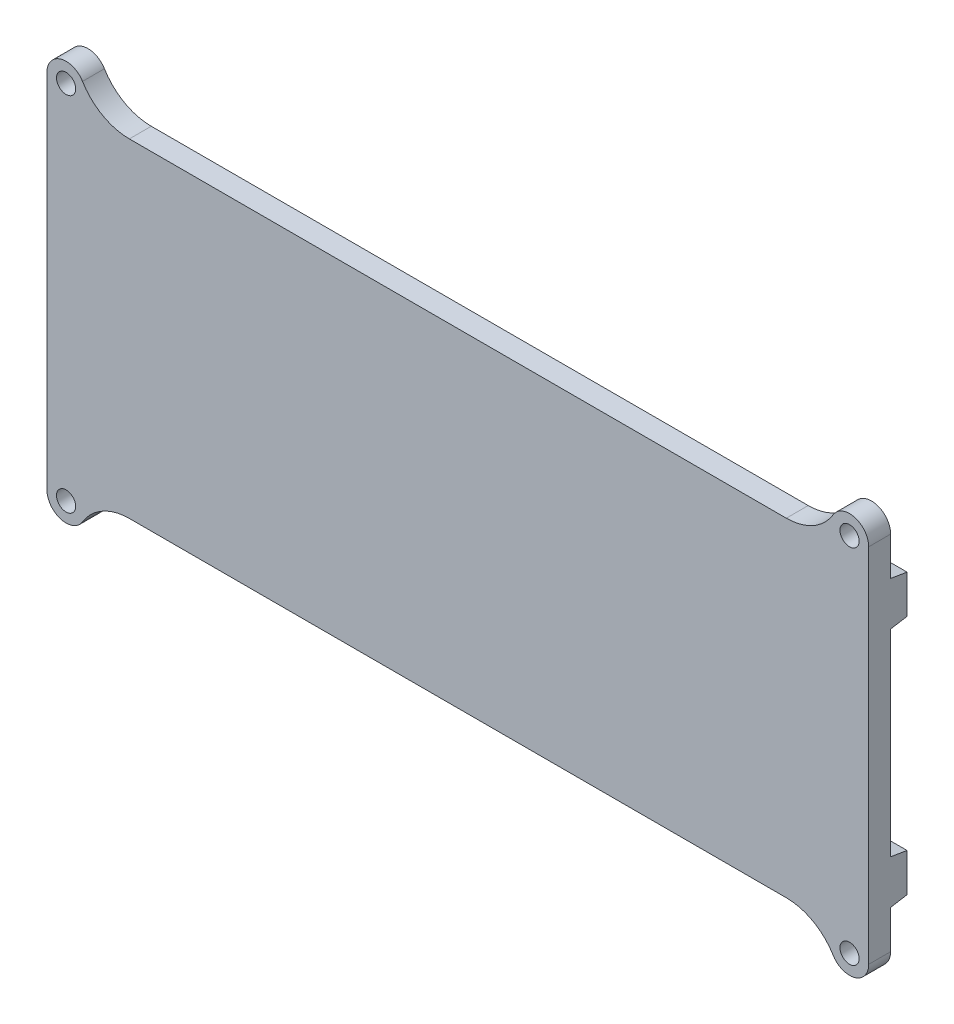
ISO-10303-21;
HEADER;
FILE_DESCRIPTION(('STEP AP214'),'2;1');
FILE_NAME('part.step','',(''),(''),'','','');
FILE_SCHEMA(('AUTOMOTIVE_DESIGN { 1 0 10303 214 1 1 1 1 }'));
ENDSEC;
DATA;
#1=APPLICATION_CONTEXT('core data for automotive mechanical design processes');
#2=APPLICATION_PROTOCOL_DEFINITION('international standard','automotive_design',2000,#1);
#3=PRODUCT_CONTEXT('',#1,'mechanical');
#4=PRODUCT('Part','Part','',(#3));
#5=PRODUCT_RELATED_PRODUCT_CATEGORY('part','',(#4));
#6=PRODUCT_DEFINITION_FORMATION('','',#4);
#7=PRODUCT_DEFINITION_CONTEXT('part definition',#1,'design');
#8=PRODUCT_DEFINITION('design','',#6,#7);
#9=PRODUCT_DEFINITION_SHAPE('','',#8);
#10=(LENGTH_UNIT() NAMED_UNIT(*) SI_UNIT(.MILLI.,.METRE.));
#11=(NAMED_UNIT(*) PLANE_ANGLE_UNIT() SI_UNIT($,.RADIAN.));
#12=(NAMED_UNIT(*) SI_UNIT($,.STERADIAN.) SOLID_ANGLE_UNIT());
#13=UNCERTAINTY_MEASURE_WITH_UNIT(LENGTH_MEASURE(1.E-05),#10,'distance_accuracy_value','');
#14=(GEOMETRIC_REPRESENTATION_CONTEXT(3) GLOBAL_UNCERTAINTY_ASSIGNED_CONTEXT((#13)) GLOBAL_UNIT_ASSIGNED_CONTEXT((#10,
#11,#12)) REPRESENTATION_CONTEXT('',''));
#15=CARTESIAN_POINT('',(0.,0.,0.));
#16=DIRECTION('',(0.,0.,1.));
#17=DIRECTION('',(1.,0.,0.));
#18=AXIS2_PLACEMENT_3D('',#15,#16,#17);
#19=CARTESIAN_POINT('',(0.,0.,0.));
#20=DIRECTION('',(0.,0.,-1.));
#21=DIRECTION('',(-1.,0.,0.));
#22=AXIS2_PLACEMENT_3D('',#19,#20,#21);
#23=PLANE('',#22);
#24=CARTESIAN_POINT('',(71.5,33.,0.));
#25=DIRECTION('',(0.,0.,-1.));
#26=DIRECTION('',(-1.,0.,0.));
#27=AXIS2_PLACEMENT_3D('',#24,#25,#26);
#28=CIRCLE('',#27,1.75);
#29=CARTESIAN_POINT('',(69.75,33.,0.));
#30=VERTEX_POINT('',#29);
#31=EDGE_CURVE('E380',#30,#30,#28,.T.);
#32=ORIENTED_EDGE('',*,*,#31,.F.);
#33=EDGE_LOOP('',(#32));
#34=FACE_BOUND('',#33,.T.);
#35=CARTESIAN_POINT('',(-71.5,33.,0.));
#36=DIRECTION('',(0.,0.,1.));
#37=DIRECTION('',(1.,0.,0.));
#38=AXIS2_PLACEMENT_3D('',#35,#36,#37);
#39=CIRCLE('',#38,1.75);
#40=CARTESIAN_POINT('',(-69.75,33.,0.));
#41=VERTEX_POINT('',#40);
#42=EDGE_CURVE('E366',#41,#41,#39,.T.);
#43=ORIENTED_EDGE('',*,*,#42,.T.);
#44=EDGE_LOOP('',(#43));
#45=FACE_BOUND('',#44,.T.);
#46=CARTESIAN_POINT('',(-71.5,-33.,0.));
#47=DIRECTION('',(0.,0.,-1.));
#48=DIRECTION('',(1.,0.,0.));
#49=AXIS2_PLACEMENT_3D('',#46,#47,#48);
#50=CIRCLE('',#49,1.75);
#51=CARTESIAN_POINT('',(-69.75,-33.,0.));
#52=VERTEX_POINT('',#51);
#53=EDGE_CURVE('E353',#52,#52,#50,.T.);
#54=ORIENTED_EDGE('',*,*,#53,.F.);
#55=EDGE_LOOP('',(#54));
#56=FACE_BOUND('',#55,.T.);
#57=CARTESIAN_POINT('',(71.5,-33.,0.));
#58=DIRECTION('',(0.,0.,1.));
#59=DIRECTION('',(-1.,0.,0.));
#60=AXIS2_PLACEMENT_3D('',#57,#58,#59);
#61=CIRCLE('',#60,1.75);
#62=CARTESIAN_POINT('',(69.75,-33.,0.));
#63=VERTEX_POINT('',#62);
#64=EDGE_CURVE('E334',#63,#63,#61,.T.);
#65=ORIENTED_EDGE('',*,*,#64,.T.);
#66=EDGE_LOOP('',(#65));
#67=FACE_BOUND('',#66,.T.);
#68=DIRECTION('',(0.,1.,0.));
#69=VECTOR('',#68,1.);
#70=CARTESIAN_POINT('',(75.,-30.,0.));
#71=LINE('',#70,#69);
#72=CARTESIAN_POINT('',(75.,26.,0.));
#73=VERTEX_POINT('',#72);
#74=CARTESIAN_POINT('',(75.,33.,0.));
#75=VERTEX_POINT('',#74);
#76=EDGE_CURVE('E418',#73,#75,#71,.T.);
#77=ORIENTED_EDGE('',*,*,#76,.F.);
#78=DIRECTION('',(1.,0.,0.));
#79=VECTOR('',#78,1.);
#80=CARTESIAN_POINT('',(71.,26.,0.));
#81=LINE('',#80,#79);
#82=CARTESIAN_POINT('',(71.,26.,0.));
#83=VERTEX_POINT('',#82);
#84=EDGE_CURVE('E47',#83,#73,#81,.T.);
#85=ORIENTED_EDGE('',*,*,#84,.F.);
#86=DIRECTION('',(0.,1.,0.));
#87=VECTOR('',#86,1.);
#88=CARTESIAN_POINT('',(71.,18.,0.));
#89=LINE('',#88,#87);
#90=CARTESIAN_POINT('',(71.,18.,0.));
#91=VERTEX_POINT('',#90);
#92=EDGE_CURVE('E221',#91,#83,#89,.T.);
#93=ORIENTED_EDGE('',*,*,#92,.F.);
#94=DIRECTION('',(1.,0.,0.));
#95=VECTOR('',#94,1.);
#96=CARTESIAN_POINT('',(71.,18.,0.));
#97=LINE('',#96,#95);
#98=CARTESIAN_POINT('',(75.,18.,0.));
#99=VERTEX_POINT('',#98);
#100=EDGE_CURVE('E229',#91,#99,#97,.T.);
#101=ORIENTED_EDGE('',*,*,#100,.T.);
#102=CARTESIAN_POINT('',(75.,-18.,0.));
#103=VERTEX_POINT('',#102);
#104=EDGE_CURVE('E421',#103,#99,#71,.T.);
#105=ORIENTED_EDGE('',*,*,#104,.F.);
#106=DIRECTION('',(1.,0.,0.));
#107=VECTOR('',#106,1.);
#108=CARTESIAN_POINT('',(71.,-18.,0.));
#109=LINE('',#108,#107);
#110=CARTESIAN_POINT('',(71.,-18.,0.));
#111=VERTEX_POINT('',#110);
#112=EDGE_CURVE('E332',#111,#103,#109,.T.);
#113=ORIENTED_EDGE('',*,*,#112,.F.);
#114=DIRECTION('',(0.,-1.,0.));
#115=VECTOR('',#114,1.);
#116=CARTESIAN_POINT('',(71.,-18.,0.));
#117=LINE('',#116,#115);
#118=CARTESIAN_POINT('',(71.,-26.,0.));
#119=VERTEX_POINT('',#118);
#120=EDGE_CURVE('E311',#111,#119,#117,.T.);
#121=ORIENTED_EDGE('',*,*,#120,.T.);
#122=DIRECTION('',(1.,0.,0.));
#123=VECTOR('',#122,1.);
#124=CARTESIAN_POINT('',(71.,-26.,0.));
#125=LINE('',#124,#123);
#126=CARTESIAN_POINT('',(75.,-26.,0.));
#127=VERTEX_POINT('',#126);
#128=EDGE_CURVE('E324',#119,#127,#125,.T.);
#129=ORIENTED_EDGE('',*,*,#128,.T.);
#130=CARTESIAN_POINT('',(75.,-33.,0.));
#131=VERTEX_POINT('',#130);
#132=EDGE_CURVE('E399',#131,#127,#71,.T.);
#133=ORIENTED_EDGE('',*,*,#132,.F.);
#134=CARTESIAN_POINT('',(71.5,-33.,0.));
#135=DIRECTION('',(0.,0.,1.));
#136=DIRECTION('',(1.,0.,0.));
#137=AXIS2_PLACEMENT_3D('',#134,#135,#136);
#138=CIRCLE('',#137,3.5);
#139=CARTESIAN_POINT('',(68.5072676050257,-34.8148148148148,0.));
#140=VERTEX_POINT('',#139);
#141=EDGE_CURVE('E344',#140,#131,#138,.T.);
#142=ORIENTED_EDGE('',*,*,#141,.F.);
#143=CARTESIAN_POINT('',(59.9566036193848,-40.,0.));
#144=DIRECTION('',(0.,0.,-1.));
#145=DIRECTION('',(-1.,0.,0.));
#146=AXIS2_PLACEMENT_3D('',#143,#144,#145);
#147=CIRCLE('',#146,10.);
#148=CARTESIAN_POINT('',(59.9566036193848,-30.,0.));
#149=VERTEX_POINT('',#148);
#150=EDGE_CURVE('E441',#140,#149,#147,.F.);
#151=ORIENTED_EDGE('',*,*,#150,.T.);
#152=DIRECTION('',(-1.,0.,0.));
#153=VECTOR('',#152,1.);
#154=CARTESIAN_POINT('',(75.,-30.,0.));
#155=LINE('',#154,#153);
#156=CARTESIAN_POINT('',(-59.9566036193848,-30.,0.));
#157=VERTEX_POINT('',#156);
#158=EDGE_CURVE('E394',#149,#157,#155,.T.);
#159=ORIENTED_EDGE('',*,*,#158,.T.);
#160=CARTESIAN_POINT('',(-59.9566036193848,-40.,0.));
#161=DIRECTION('',(0.,0.,-1.));
#162=DIRECTION('',(-1.,0.,0.));
#163=AXIS2_PLACEMENT_3D('',#160,#161,#162);
#164=CIRCLE('',#163,10.);
#165=CARTESIAN_POINT('',(-68.5072676050257,-34.8148148148148,0.));
#166=VERTEX_POINT('',#165);
#167=EDGE_CURVE('E445',#157,#166,#164,.F.);
#168=ORIENTED_EDGE('',*,*,#167,.T.);
#169=CARTESIAN_POINT('',(-71.5,-33.,0.));
#170=DIRECTION('',(0.,0.,-1.));
#171=DIRECTION('',(-1.,0.,0.));
#172=AXIS2_PLACEMENT_3D('',#169,#170,#171);
#173=CIRCLE('',#172,3.5);
#174=CARTESIAN_POINT('',(-75.,-33.,0.));
#175=VERTEX_POINT('',#174);
#176=EDGE_CURVE('E357',#166,#175,#173,.T.);
#177=ORIENTED_EDGE('',*,*,#176,.T.);
#178=DIRECTION('',(0.,1.,0.));
#179=VECTOR('',#178,1.);
#180=CARTESIAN_POINT('',(-75.,-30.,0.));
#181=LINE('',#180,#179);
#182=CARTESIAN_POINT('',(-75.,-26.,0.));
#183=VERTEX_POINT('',#182);
#184=EDGE_CURVE('E412',#175,#183,#181,.T.);
#185=ORIENTED_EDGE('',*,*,#184,.T.);
#186=DIRECTION('',(-1.,0.,0.));
#187=VECTOR('',#186,1.);
#188=CARTESIAN_POINT('',(-71.,-26.,0.));
#189=LINE('',#188,#187);
#190=CARTESIAN_POINT('',(-71.,-26.,0.));
#191=VERTEX_POINT('',#190);
#192=EDGE_CURVE('E299',#191,#183,#189,.T.);
#193=ORIENTED_EDGE('',*,*,#192,.F.);
#194=DIRECTION('',(0.,-1.,0.));
#195=VECTOR('',#194,1.);
#196=CARTESIAN_POINT('',(-71.,-18.,0.));
#197=LINE('',#196,#195);
#198=CARTESIAN_POINT('',(-71.,-18.,0.));
#199=VERTEX_POINT('',#198);
#200=EDGE_CURVE('E282',#199,#191,#197,.T.);
#201=ORIENTED_EDGE('',*,*,#200,.F.);
#202=DIRECTION('',(-1.,0.,0.));
#203=VECTOR('',#202,1.);
#204=CARTESIAN_POINT('',(-71.,-18.,0.));
#205=LINE('',#204,#203);
#206=CARTESIAN_POINT('',(-75.,-18.,0.));
#207=VERTEX_POINT('',#206);
#208=EDGE_CURVE('E293',#199,#207,#205,.T.);
#209=ORIENTED_EDGE('',*,*,#208,.T.);
#210=CARTESIAN_POINT('',(-75.,18.,0.));
#211=VERTEX_POINT('',#210);
#212=EDGE_CURVE('E415',#207,#211,#181,.T.);
#213=ORIENTED_EDGE('',*,*,#212,.T.);
#214=DIRECTION('',(-1.,0.,0.));
#215=VECTOR('',#214,1.);
#216=CARTESIAN_POINT('',(-71.,18.,0.));
#217=LINE('',#216,#215);
#218=CARTESIAN_POINT('',(-71.,18.,0.));
#219=VERTEX_POINT('',#218);
#220=EDGE_CURVE('E273',#219,#211,#217,.T.);
#221=ORIENTED_EDGE('',*,*,#220,.F.);
#222=DIRECTION('',(0.,1.,0.));
#223=VECTOR('',#222,1.);
#224=CARTESIAN_POINT('',(-71.,18.,0.));
#225=LINE('',#224,#223);
#226=CARTESIAN_POINT('',(-71.,26.,0.));
#227=VERTEX_POINT('',#226);
#228=EDGE_CURVE('E55',#219,#227,#225,.T.);
#229=ORIENTED_EDGE('',*,*,#228,.T.);
#230=DIRECTION('',(-1.,0.,0.));
#231=VECTOR('',#230,1.);
#232=CARTESIAN_POINT('',(-71.,26.,0.));
#233=LINE('',#232,#231);
#234=CARTESIAN_POINT('',(-75.,26.,0.));
#235=VERTEX_POINT('',#234);
#236=EDGE_CURVE('E265',#227,#235,#233,.T.);
#237=ORIENTED_EDGE('',*,*,#236,.T.);
#238=CARTESIAN_POINT('',(-75.,33.,0.));
#239=VERTEX_POINT('',#238);
#240=EDGE_CURVE('E411',#235,#239,#181,.T.);
#241=ORIENTED_EDGE('',*,*,#240,.T.);
#242=CARTESIAN_POINT('',(-71.5,33.,0.));
#243=DIRECTION('',(0.,0.,1.));
#244=DIRECTION('',(-1.,0.,0.));
#245=AXIS2_PLACEMENT_3D('',#242,#243,#244);
#246=CIRCLE('',#245,3.5);
#247=CARTESIAN_POINT('',(-68.5072676050257,34.8148148148148,0.));
#248=VERTEX_POINT('',#247);
#249=EDGE_CURVE('E370',#248,#239,#246,.T.);
#250=ORIENTED_EDGE('',*,*,#249,.F.);
#251=CARTESIAN_POINT('',(-59.9566036193848,40.,0.));
#252=DIRECTION('',(0.,0.,-1.));
#253=DIRECTION('',(-1.,0.,0.));
#254=AXIS2_PLACEMENT_3D('',#251,#252,#253);
#255=CIRCLE('',#254,10.);
#256=CARTESIAN_POINT('',(-59.9566036193848,30.,0.));
#257=VERTEX_POINT('',#256);
#258=EDGE_CURVE('E40',#248,#257,#255,.F.);
#259=ORIENTED_EDGE('',*,*,#258,.T.);
#260=DIRECTION('',(-1.,0.,0.));
#261=VECTOR('',#260,1.);
#262=CARTESIAN_POINT('',(75.,30.,0.));
#263=LINE('',#262,#261);
#264=CARTESIAN_POINT('',(59.9566036193848,30.,0.));
#265=VERTEX_POINT('',#264);
#266=EDGE_CURVE('E414',#265,#257,#263,.T.);
#267=ORIENTED_EDGE('',*,*,#266,.F.);
#268=CARTESIAN_POINT('',(59.9566036193848,40.,0.));
#269=DIRECTION('',(0.,0.,-1.));
#270=DIRECTION('',(-1.,0.,0.));
#271=AXIS2_PLACEMENT_3D('',#268,#269,#270);
#272=CIRCLE('',#271,10.);
#273=CARTESIAN_POINT('',(68.5072676050257,34.8148148148148,0.));
#274=VERTEX_POINT('',#273);
#275=EDGE_CURVE('E449',#265,#274,#272,.F.);
#276=ORIENTED_EDGE('',*,*,#275,.T.);
#277=CARTESIAN_POINT('',(71.5,33.,0.));
#278=DIRECTION('',(0.,0.,-1.));
#279=DIRECTION('',(1.,0.,0.));
#280=AXIS2_PLACEMENT_3D('',#277,#278,#279);
#281=CIRCLE('',#280,3.5);
#282=EDGE_CURVE('E384',#274,#75,#281,.T.);
#283=ORIENTED_EDGE('',*,*,#282,.T.);
#284=EDGE_LOOP('',(#77,#85,#93,#101,#105,#113,#121,#129,#133,#142,#151,#159,#168,#177,#185,#193,
#201,#209,#213,#221,#229,#237,#241,#250,#259,#267,#276,#283));
#285=FACE_BOUND('',#284,.T.);
#286=ADVANCED_FACE('F32',(#34,#45,#56,#67,#285),#23,.T.);
#287=CARTESIAN_POINT('',(75.,-30.,4.));
#288=DIRECTION('',(0.,-1.,0.));
#289=DIRECTION('',(1.,0.,0.));
#290=AXIS2_PLACEMENT_3D('',#287,#288,#289);
#291=PLANE('',#290);
#292=ORIENTED_EDGE('',*,*,#158,.F.);
#293=DIRECTION('',(0.,0.,-1.));
#294=VECTOR('',#293,1.);
#295=CARTESIAN_POINT('',(59.9566036193848,-30.,4.));
#296=LINE('',#295,#294);
#297=CARTESIAN_POINT('',(59.9566036193848,-30.,4.));
#298=VERTEX_POINT('',#297);
#299=EDGE_CURVE('E427',#149,#298,#296,.F.);
#300=ORIENTED_EDGE('',*,*,#299,.T.);
#301=DIRECTION('',(-1.,0.,0.));
#302=VECTOR('',#301,1.);
#303=CARTESIAN_POINT('',(75.,-30.,4.));
#304=LINE('',#303,#302);
#305=CARTESIAN_POINT('',(-59.9566036193848,-30.,4.));
#306=VERTEX_POINT('',#305);
#307=EDGE_CURVE('E395',#298,#306,#304,.T.);
#308=ORIENTED_EDGE('',*,*,#307,.T.);
#309=DIRECTION('',(0.,0.,1.));
#310=VECTOR('',#309,1.);
#311=CARTESIAN_POINT('',(-59.9566036193848,-30.,0.));
#312=LINE('',#311,#310);
#313=EDGE_CURVE('E424',#306,#157,#312,.F.);
#314=ORIENTED_EDGE('',*,*,#313,.T.);
#315=EDGE_LOOP('',(#292,#300,#308,#314));
#316=FACE_BOUND('',#315,.T.);
#317=ADVANCED_FACE('F484',(#316),#291,.T.);
#318=CARTESIAN_POINT('',(75.,30.,4.));
#319=DIRECTION('',(0.,-1.,0.));
#320=DIRECTION('',(1.,0.,0.));
#321=AXIS2_PLACEMENT_3D('',#318,#319,#320);
#322=PLANE('',#321);
#323=DIRECTION('',(-1.,0.,0.));
#324=VECTOR('',#323,1.);
#325=CARTESIAN_POINT('',(75.,30.,4.));
#326=LINE('',#325,#324);
#327=CARTESIAN_POINT('',(59.9566036193848,30.,4.));
#328=VERTEX_POINT('',#327);
#329=CARTESIAN_POINT('',(-59.9566036193848,30.,4.));
#330=VERTEX_POINT('',#329);
#331=EDGE_CURVE('E402',#328,#330,#326,.T.);
#332=ORIENTED_EDGE('',*,*,#331,.F.);
#333=DIRECTION('',(0.,0.,-1.));
#334=VECTOR('',#333,1.);
#335=CARTESIAN_POINT('',(59.9566036193848,30.,4.));
#336=LINE('',#335,#334);
#337=EDGE_CURVE('E433',#328,#265,#336,.T.);
#338=ORIENTED_EDGE('',*,*,#337,.T.);
#339=ORIENTED_EDGE('',*,*,#266,.T.);
#340=DIRECTION('',(0.,0.,1.));
#341=VECTOR('',#340,1.);
#342=CARTESIAN_POINT('',(-59.9566036193848,30.,4.));
#343=LINE('',#342,#341);
#344=EDGE_CURVE('E431',#257,#330,#343,.T.);
#345=ORIENTED_EDGE('',*,*,#344,.T.);
#346=EDGE_LOOP('',(#332,#338,#339,#345));
#347=FACE_BOUND('',#346,.T.);
#348=ADVANCED_FACE('F459',(#347),#322,.F.);
#349=CARTESIAN_POINT('',(75.,-30.,4.));
#350=DIRECTION('',(-1.,0.,0.));
#351=DIRECTION('',(0.,0.,1.));
#352=AXIS2_PLACEMENT_3D('',#349,#350,#351);
#353=PLANE('',#352);
#354=ORIENTED_EDGE('',*,*,#132,.T.);
#355=DIRECTION('',(0.,0.164398987305357,-0.986393923832144));
#356=VECTOR('',#355,1.);
#357=CARTESIAN_POINT('',(75.,-26.,0.));
#358=LINE('',#357,#356);
#359=CARTESIAN_POINT('',(75.,-25.5,-3.));
#360=VERTEX_POINT('',#359);
#361=EDGE_CURVE('E302',#127,#360,#358,.T.);
#362=ORIENTED_EDGE('',*,*,#361,.T.);
#363=DIRECTION('',(0.,1.,0.));
#364=VECTOR('',#363,1.);
#365=CARTESIAN_POINT('',(75.,-25.5,-3.));
#366=LINE('',#365,#364);
#367=CARTESIAN_POINT('',(75.,-18.5,-3.));
#368=VERTEX_POINT('',#367);
#369=EDGE_CURVE('E327',#360,#368,#366,.T.);
#370=ORIENTED_EDGE('',*,*,#369,.T.);
#371=DIRECTION('',(0.,0.164398987305356,0.986393923832144));
#372=VECTOR('',#371,1.);
#373=CARTESIAN_POINT('',(75.,-18.5,-3.));
#374=LINE('',#373,#372);
#375=EDGE_CURVE('E315',#368,#103,#374,.T.);
#376=ORIENTED_EDGE('',*,*,#375,.T.);
#377=ORIENTED_EDGE('',*,*,#104,.T.);
#378=DIRECTION('',(0.,-0.164398987305356,0.986393923832144));
#379=VECTOR('',#378,1.);
#380=CARTESIAN_POINT('',(75.,18.5,-3.));
#381=LINE('',#380,#379);
#382=CARTESIAN_POINT('',(75.,18.5,-3.));
#383=VERTEX_POINT('',#382);
#384=EDGE_CURVE('E232',#383,#99,#381,.T.);
#385=ORIENTED_EDGE('',*,*,#384,.F.);
#386=DIRECTION('',(0.,-1.,0.));
#387=VECTOR('',#386,1.);
#388=CARTESIAN_POINT('',(75.,25.5,-3.));
#389=LINE('',#388,#387);
#390=CARTESIAN_POINT('',(75.,25.5,-3.));
#391=VERTEX_POINT('',#390);
#392=EDGE_CURVE('E241',#391,#383,#389,.T.);
#393=ORIENTED_EDGE('',*,*,#392,.F.);
#394=DIRECTION('',(0.,-0.164398987305357,-0.986393923832144));
#395=VECTOR('',#394,1.);
#396=CARTESIAN_POINT('',(75.,26.,0.));
#397=LINE('',#396,#395);
#398=EDGE_CURVE('E239',#73,#391,#397,.T.);
#399=ORIENTED_EDGE('',*,*,#398,.F.);
#400=ORIENTED_EDGE('',*,*,#76,.T.);
#401=DIRECTION('',(0.,0.,-1.));
#402=VECTOR('',#401,1.);
#403=CARTESIAN_POINT('',(75.,33.,4.));
#404=LINE('',#403,#402);
#405=CARTESIAN_POINT('',(75.,33.,4.));
#406=VERTEX_POINT('',#405);
#407=EDGE_CURVE('E389',#406,#75,#404,.T.);
#408=ORIENTED_EDGE('',*,*,#407,.F.);
#409=DIRECTION('',(0.,1.,0.));
#410=VECTOR('',#409,1.);
#411=CARTESIAN_POINT('',(75.,-30.,4.));
#412=LINE('',#411,#410);
#413=CARTESIAN_POINT('',(75.,-33.,4.));
#414=VERTEX_POINT('',#413);
#415=EDGE_CURVE('E405',#414,#406,#412,.T.);
#416=ORIENTED_EDGE('',*,*,#415,.F.);
#417=DIRECTION('',(0.,0.,-1.));
#418=VECTOR('',#417,1.);
#419=CARTESIAN_POINT('',(75.,-33.,4.));
#420=LINE('',#419,#418);
#421=EDGE_CURVE('E349',#414,#131,#420,.T.);
#422=ORIENTED_EDGE('',*,*,#421,.T.);
#423=EDGE_LOOP('',(#354,#362,#370,#376,#377,#385,#393,#399,#400,#408,#416,#422));
#424=FACE_BOUND('',#423,.T.);
#425=ADVANCED_FACE('F501',(#424),#353,.F.);
#426=CARTESIAN_POINT('',(-75.,-30.,4.));
#427=DIRECTION('',(-1.,0.,0.));
#428=DIRECTION('',(0.,0.,1.));
#429=AXIS2_PLACEMENT_3D('',#426,#427,#428);
#430=PLANE('',#429);
#431=ORIENTED_EDGE('',*,*,#184,.F.);
#432=DIRECTION('',(0.,0.,-1.));
#433=VECTOR('',#432,1.);
#434=CARTESIAN_POINT('',(-75.,-33.,4.));
#435=LINE('',#434,#433);
#436=CARTESIAN_POINT('',(-75.,-33.,4.));
#437=VERTEX_POINT('',#436);
#438=EDGE_CURVE('E362',#437,#175,#435,.T.);
#439=ORIENTED_EDGE('',*,*,#438,.F.);
#440=DIRECTION('',(0.,1.,0.));
#441=VECTOR('',#440,1.);
#442=CARTESIAN_POINT('',(-75.,-30.,4.));
#443=LINE('',#442,#441);
#444=CARTESIAN_POINT('',(-75.,33.,4.));
#445=VERTEX_POINT('',#444);
#446=EDGE_CURVE('E398',#437,#445,#443,.T.);
#447=ORIENTED_EDGE('',*,*,#446,.T.);
#448=DIRECTION('',(0.,0.,-1.));
#449=VECTOR('',#448,1.);
#450=CARTESIAN_POINT('',(-75.,33.,4.));
#451=LINE('',#450,#449);
#452=EDGE_CURVE('E375',#445,#239,#451,.T.);
#453=ORIENTED_EDGE('',*,*,#452,.T.);
#454=ORIENTED_EDGE('',*,*,#240,.F.);
#455=DIRECTION('',(0.,-0.164398987305357,-0.986393923832144));
#456=VECTOR('',#455,1.);
#457=CARTESIAN_POINT('',(-75.,26.,0.));
#458=LINE('',#457,#456);
#459=CARTESIAN_POINT('',(-75.,25.5,-3.));
#460=VERTEX_POINT('',#459);
#461=EDGE_CURVE('E249',#235,#460,#458,.T.);
#462=ORIENTED_EDGE('',*,*,#461,.T.);
#463=DIRECTION('',(0.,-1.,0.));
#464=VECTOR('',#463,1.);
#465=CARTESIAN_POINT('',(-75.,25.5,-3.));
#466=LINE('',#465,#464);
#467=CARTESIAN_POINT('',(-75.,18.5,-3.));
#468=VERTEX_POINT('',#467);
#469=EDGE_CURVE('E268',#460,#468,#466,.T.);
#470=ORIENTED_EDGE('',*,*,#469,.T.);
#471=DIRECTION('',(0.,-0.164398987305356,0.986393923832144));
#472=VECTOR('',#471,1.);
#473=CARTESIAN_POINT('',(-75.,18.5,-3.));
#474=LINE('',#473,#472);
#475=EDGE_CURVE('E256',#468,#211,#474,.T.);
#476=ORIENTED_EDGE('',*,*,#475,.T.);
#477=ORIENTED_EDGE('',*,*,#212,.F.);
#478=DIRECTION('',(0.,0.164398987305356,0.986393923832144));
#479=VECTOR('',#478,1.);
#480=CARTESIAN_POINT('',(-75.,-18.5,-3.));
#481=LINE('',#480,#479);
#482=CARTESIAN_POINT('',(-75.,-18.5,-3.));
#483=VERTEX_POINT('',#482);
#484=EDGE_CURVE('E276',#483,#207,#481,.T.);
#485=ORIENTED_EDGE('',*,*,#484,.F.);
#486=DIRECTION('',(0.,1.,0.));
#487=VECTOR('',#486,1.);
#488=CARTESIAN_POINT('',(-75.,-25.5,-3.));
#489=LINE('',#488,#487);
#490=CARTESIAN_POINT('',(-75.,-25.5,-3.));
#491=VERTEX_POINT('',#490);
#492=EDGE_CURVE('E296',#491,#483,#489,.T.);
#493=ORIENTED_EDGE('',*,*,#492,.F.);
#494=DIRECTION('',(0.,0.164398987305357,-0.986393923832144));
#495=VECTOR('',#494,1.);
#496=CARTESIAN_POINT('',(-75.,-26.,0.));
#497=LINE('',#496,#495);
#498=EDGE_CURVE('E286',#183,#491,#497,.T.);
#499=ORIENTED_EDGE('',*,*,#498,.F.);
#500=EDGE_LOOP('',(#431,#439,#447,#453,#454,#462,#470,#476,#477,#485,#493,#499));
#501=FACE_BOUND('',#500,.T.);
#502=ADVANCED_FACE('F473',(#501),#430,.T.);
#503=CARTESIAN_POINT('',(0.,0.,4.));
#504=DIRECTION('',(0.,0.,-1.));
#505=DIRECTION('',(-1.,0.,0.));
#506=AXIS2_PLACEMENT_3D('',#503,#504,#505);
#507=PLANE('',#506);
#508=ORIENTED_EDGE('',*,*,#307,.F.);
#509=CARTESIAN_POINT('',(59.9566036193848,-40.,4.));
#510=DIRECTION('',(0.,0.,-1.));
#511=DIRECTION('',(-1.,0.,0.));
#512=AXIS2_PLACEMENT_3D('',#509,#510,#511);
#513=CIRCLE('',#512,10.);
#514=CARTESIAN_POINT('',(68.5072676050257,-34.8148148148148,4.));
#515=VERTEX_POINT('',#514);
#516=EDGE_CURVE('E443',#298,#515,#513,.T.);
#517=ORIENTED_EDGE('',*,*,#516,.T.);
#518=CARTESIAN_POINT('',(71.5,-33.,4.));
#519=DIRECTION('',(0.,0.,1.));
#520=DIRECTION('',(1.,0.,0.));
#521=AXIS2_PLACEMENT_3D('',#518,#519,#520);
#522=CIRCLE('',#521,3.5);
#523=EDGE_CURVE('E347',#515,#414,#522,.T.);
#524=ORIENTED_EDGE('',*,*,#523,.T.);
#525=ORIENTED_EDGE('',*,*,#415,.T.);
#526=CARTESIAN_POINT('',(71.5,33.,4.));
#527=DIRECTION('',(0.,0.,-1.));
#528=DIRECTION('',(1.,0.,0.));
#529=AXIS2_PLACEMENT_3D('',#526,#527,#528);
#530=CIRCLE('',#529,3.5);
#531=CARTESIAN_POINT('',(68.5072676050257,34.8148148148148,4.));
#532=VERTEX_POINT('',#531);
#533=EDGE_CURVE('E387',#532,#406,#530,.T.);
#534=ORIENTED_EDGE('',*,*,#533,.F.);
#535=CARTESIAN_POINT('',(59.9566036193848,40.,4.));
#536=DIRECTION('',(0.,0.,-1.));
#537=DIRECTION('',(-1.,0.,0.));
#538=AXIS2_PLACEMENT_3D('',#535,#536,#537);
#539=CIRCLE('',#538,10.);
#540=EDGE_CURVE('E451',#532,#328,#539,.T.);
#541=ORIENTED_EDGE('',*,*,#540,.T.);
#542=ORIENTED_EDGE('',*,*,#331,.T.);
#543=CARTESIAN_POINT('',(-59.9566036193848,40.,4.));
#544=DIRECTION('',(0.,0.,-1.));
#545=DIRECTION('',(-1.,0.,0.));
#546=AXIS2_PLACEMENT_3D('',#543,#544,#545);
#547=CIRCLE('',#546,10.);
#548=CARTESIAN_POINT('',(-68.5072676050257,34.8148148148148,4.));
#549=VERTEX_POINT('',#548);
#550=EDGE_CURVE('E11',#330,#549,#547,.T.);
#551=ORIENTED_EDGE('',*,*,#550,.T.);
#552=CARTESIAN_POINT('',(-71.5,33.,4.));
#553=DIRECTION('',(0.,0.,1.));
#554=DIRECTION('',(-1.,0.,0.));
#555=AXIS2_PLACEMENT_3D('',#552,#553,#554);
#556=CIRCLE('',#555,3.5);
#557=EDGE_CURVE('E373',#549,#445,#556,.T.);
#558=ORIENTED_EDGE('',*,*,#557,.T.);
#559=ORIENTED_EDGE('',*,*,#446,.F.);
#560=CARTESIAN_POINT('',(-71.5,-33.,4.));
#561=DIRECTION('',(0.,0.,-1.));
#562=DIRECTION('',(-1.,0.,0.));
#563=AXIS2_PLACEMENT_3D('',#560,#561,#562);
#564=CIRCLE('',#563,3.5);
#565=CARTESIAN_POINT('',(-68.5072676050257,-34.8148148148148,4.));
#566=VERTEX_POINT('',#565);
#567=EDGE_CURVE('E360',#566,#437,#564,.T.);
#568=ORIENTED_EDGE('',*,*,#567,.F.);
#569=CARTESIAN_POINT('',(-59.9566036193848,-40.,4.));
#570=DIRECTION('',(0.,0.,-1.));
#571=DIRECTION('',(-1.,0.,0.));
#572=AXIS2_PLACEMENT_3D('',#569,#570,#571);
#573=CIRCLE('',#572,10.);
#574=EDGE_CURVE('E447',#566,#306,#573,.T.);
#575=ORIENTED_EDGE('',*,*,#574,.T.);
#576=EDGE_LOOP('',(#508,#517,#524,#525,#534,#541,#542,#551,#558,#559,#568,#575));
#577=FACE_BOUND('',#576,.T.);
#578=CARTESIAN_POINT('',(71.5,33.,4.));
#579=DIRECTION('',(0.,0.,-1.));
#580=DIRECTION('',(-1.,0.,0.));
#581=AXIS2_PLACEMENT_3D('',#578,#579,#580);
#582=CIRCLE('',#581,1.75);
#583=CARTESIAN_POINT('',(69.75,33.,4.));
#584=VERTEX_POINT('',#583);
#585=EDGE_CURVE('E381',#584,#584,#582,.T.);
#586=ORIENTED_EDGE('',*,*,#585,.T.);
#587=EDGE_LOOP('',(#586));
#588=FACE_BOUND('',#587,.T.);
#589=CARTESIAN_POINT('',(-71.5,33.,4.));
#590=DIRECTION('',(0.,0.,1.));
#591=DIRECTION('',(1.,0.,0.));
#592=AXIS2_PLACEMENT_3D('',#589,#590,#591);
#593=CIRCLE('',#592,1.75);
#594=CARTESIAN_POINT('',(-69.75,33.,4.));
#595=VERTEX_POINT('',#594);
#596=EDGE_CURVE('E367',#595,#595,#593,.T.);
#597=ORIENTED_EDGE('',*,*,#596,.F.);
#598=EDGE_LOOP('',(#597));
#599=FACE_BOUND('',#598,.T.);
#600=CARTESIAN_POINT('',(-71.5,-33.,4.));
#601=DIRECTION('',(0.,0.,-1.));
#602=DIRECTION('',(1.,0.,0.));
#603=AXIS2_PLACEMENT_3D('',#600,#601,#602);
#604=CIRCLE('',#603,1.75);
#605=CARTESIAN_POINT('',(-69.75,-33.,4.));
#606=VERTEX_POINT('',#605);
#607=EDGE_CURVE('E354',#606,#606,#604,.T.);
#608=ORIENTED_EDGE('',*,*,#607,.T.);
#609=EDGE_LOOP('',(#608));
#610=FACE_BOUND('',#609,.T.);
#611=CARTESIAN_POINT('',(71.5,-33.,4.));
#612=DIRECTION('',(0.,0.,1.));
#613=DIRECTION('',(-1.,0.,0.));
#614=AXIS2_PLACEMENT_3D('',#611,#612,#613);
#615=CIRCLE('',#614,1.75);
#616=CARTESIAN_POINT('',(69.75,-33.,4.));
#617=VERTEX_POINT('',#616);
#618=EDGE_CURVE('E341',#617,#617,#615,.T.);
#619=ORIENTED_EDGE('',*,*,#618,.F.);
#620=EDGE_LOOP('',(#619));
#621=FACE_BOUND('',#620,.T.);
#622=ADVANCED_FACE('F465',(#577,#588,#599,#610,#621),#507,.F.);
#623=CARTESIAN_POINT('',(71.5,33.,4.));
#624=DIRECTION('',(0.,0.,-1.));
#625=DIRECTION('',(-1.,0.,0.));
#626=AXIS2_PLACEMENT_3D('',#623,#624,#625);
#627=CYLINDRICAL_SURFACE('',#626,3.5);
#628=ORIENTED_EDGE('',*,*,#282,.F.);
#629=DIRECTION('',(0.,0.,-1.));
#630=VECTOR('',#629,1.);
#631=CARTESIAN_POINT('',(68.5072676050257,34.8148148148148,4.));
#632=LINE('',#631,#630);
#633=EDGE_CURVE('E436',#274,#532,#632,.F.);
#634=ORIENTED_EDGE('',*,*,#633,.T.);
#635=ORIENTED_EDGE('',*,*,#533,.T.);
#636=ORIENTED_EDGE('',*,*,#407,.T.);
#637=EDGE_LOOP('',(#628,#634,#635,#636));
#638=FACE_BOUND('',#637,.T.);
#639=ADVANCED_FACE('F504',(#638),#627,.T.);
#640=CARTESIAN_POINT('',(71.5,33.,4.));
#641=DIRECTION('',(0.,0.,-1.));
#642=DIRECTION('',(-1.,0.,0.));
#643=AXIS2_PLACEMENT_3D('',#640,#641,#642);
#644=CYLINDRICAL_SURFACE('',#643,1.75);
#645=ORIENTED_EDGE('',*,*,#585,.F.);
#646=EDGE_LOOP('',(#645));
#647=FACE_BOUND('',#646,.T.);
#648=ORIENTED_EDGE('',*,*,#31,.T.);
#649=EDGE_LOOP('',(#648));
#650=FACE_BOUND('',#649,.T.);
#651=ADVANCED_FACE('F755',(#647,#650),#644,.F.);
#652=CARTESIAN_POINT('',(-71.5,33.,4.));
#653=DIRECTION('',(0.,0.,-1.));
#654=DIRECTION('',(-1.,0.,0.));
#655=AXIS2_PLACEMENT_3D('',#652,#653,#654);
#656=CYLINDRICAL_SURFACE('',#655,3.5);
#657=ORIENTED_EDGE('',*,*,#557,.F.);
#658=DIRECTION('',(0.,0.,-1.));
#659=VECTOR('',#658,1.);
#660=CARTESIAN_POINT('',(-68.5072676050257,34.8148148148148,4.));
#661=LINE('',#660,#659);
#662=EDGE_CURVE('E438',#549,#248,#661,.T.);
#663=ORIENTED_EDGE('',*,*,#662,.T.);
#664=ORIENTED_EDGE('',*,*,#249,.T.);
#665=ORIENTED_EDGE('',*,*,#452,.F.);
#666=EDGE_LOOP('',(#657,#663,#664,#665));
#667=FACE_BOUND('',#666,.T.);
#668=ADVANCED_FACE('F470',(#667),#656,.T.);
#669=CARTESIAN_POINT('',(-71.5,33.,4.));
#670=DIRECTION('',(0.,0.,-1.));
#671=DIRECTION('',(-1.,0.,0.));
#672=AXIS2_PLACEMENT_3D('',#669,#670,#671);
#673=CYLINDRICAL_SURFACE('',#672,1.75);
#674=ORIENTED_EDGE('',*,*,#596,.T.);
#675=EDGE_LOOP('',(#674));
#676=FACE_BOUND('',#675,.T.);
#677=ORIENTED_EDGE('',*,*,#42,.F.);
#678=EDGE_LOOP('',(#677));
#679=FACE_BOUND('',#678,.T.);
#680=ADVANCED_FACE('F741',(#676,#679),#673,.F.);
#681=CARTESIAN_POINT('',(-71.5,-33.,4.));
#682=DIRECTION('',(0.,0.,-1.));
#683=DIRECTION('',(-1.,0.,0.));
#684=AXIS2_PLACEMENT_3D('',#681,#682,#683);
#685=CYLINDRICAL_SURFACE('',#684,3.5);
#686=ORIENTED_EDGE('',*,*,#176,.F.);
#687=DIRECTION('',(0.,0.,-1.));
#688=VECTOR('',#687,1.);
#689=CARTESIAN_POINT('',(-68.5072676050257,-34.8148148148148,4.));
#690=LINE('',#689,#688);
#691=EDGE_CURVE('E429',#166,#566,#690,.F.);
#692=ORIENTED_EDGE('',*,*,#691,.T.);
#693=ORIENTED_EDGE('',*,*,#567,.T.);
#694=ORIENTED_EDGE('',*,*,#438,.T.);
#695=EDGE_LOOP('',(#686,#692,#693,#694));
#696=FACE_BOUND('',#695,.T.);
#697=ADVANCED_FACE('F738',(#696),#685,.T.);
#698=CARTESIAN_POINT('',(-71.5,-33.,4.));
#699=DIRECTION('',(0.,0.,-1.));
#700=DIRECTION('',(-1.,0.,0.));
#701=AXIS2_PLACEMENT_3D('',#698,#699,#700);
#702=CYLINDRICAL_SURFACE('',#701,1.75);
#703=ORIENTED_EDGE('',*,*,#607,.F.);
#704=EDGE_LOOP('',(#703));
#705=FACE_BOUND('',#704,.T.);
#706=ORIENTED_EDGE('',*,*,#53,.T.);
#707=EDGE_LOOP('',(#706));
#708=FACE_BOUND('',#707,.T.);
#709=ADVANCED_FACE('F740',(#705,#708),#702,.F.);
#710=CARTESIAN_POINT('',(71.5,-33.,4.));
#711=DIRECTION('',(0.,0.,-1.));
#712=DIRECTION('',(-1.,0.,0.));
#713=AXIS2_PLACEMENT_3D('',#710,#711,#712);
#714=CYLINDRICAL_SURFACE('',#713,3.5);
#715=ORIENTED_EDGE('',*,*,#523,.F.);
#716=DIRECTION('',(0.,0.,-1.));
#717=VECTOR('',#716,1.);
#718=CARTESIAN_POINT('',(68.5072676050257,-34.8148148148148,4.));
#719=LINE('',#718,#717);
#720=EDGE_CURVE('E408',#515,#140,#719,.T.);
#721=ORIENTED_EDGE('',*,*,#720,.T.);
#722=ORIENTED_EDGE('',*,*,#141,.T.);
#723=ORIENTED_EDGE('',*,*,#421,.F.);
#724=EDGE_LOOP('',(#715,#721,#722,#723));
#725=FACE_BOUND('',#724,.T.);
#726=ADVANCED_FACE('F495',(#725),#714,.T.);
#727=CARTESIAN_POINT('',(71.5,-33.,4.));
#728=DIRECTION('',(0.,0.,-1.));
#729=DIRECTION('',(-1.,0.,0.));
#730=AXIS2_PLACEMENT_3D('',#727,#728,#729);
#731=CYLINDRICAL_SURFACE('',#730,1.75);
#732=ORIENTED_EDGE('',*,*,#618,.T.);
#733=EDGE_LOOP('',(#732));
#734=FACE_BOUND('',#733,.T.);
#735=ORIENTED_EDGE('',*,*,#64,.F.);
#736=EDGE_LOOP('',(#735));
#737=FACE_BOUND('',#736,.T.);
#738=ADVANCED_FACE('F552',(#734,#737),#731,.F.);
#739=CARTESIAN_POINT('',(59.9566036193848,-40.,4.));
#740=DIRECTION('',(0.,0.,-1.));
#741=DIRECTION('',(-1.,0.,0.));
#742=AXIS2_PLACEMENT_3D('',#739,#740,#741);
#743=CYLINDRICAL_SURFACE('',#742,10.);
#744=ORIENTED_EDGE('',*,*,#516,.F.);
#745=ORIENTED_EDGE('',*,*,#299,.F.);
#746=ORIENTED_EDGE('',*,*,#150,.F.);
#747=ORIENTED_EDGE('',*,*,#720,.F.);
#748=EDGE_LOOP('',(#744,#745,#746,#747));
#749=FACE_BOUND('',#748,.T.);
#750=ADVANCED_FACE('F492',(#749),#743,.F.);
#751=CARTESIAN_POINT('',(-59.9566036193848,-40.,4.));
#752=DIRECTION('',(0.,0.,-1.));
#753=DIRECTION('',(-1.,0.,0.));
#754=AXIS2_PLACEMENT_3D('',#751,#752,#753);
#755=CYLINDRICAL_SURFACE('',#754,10.);
#756=ORIENTED_EDGE('',*,*,#574,.F.);
#757=ORIENTED_EDGE('',*,*,#691,.F.);
#758=ORIENTED_EDGE('',*,*,#167,.F.);
#759=ORIENTED_EDGE('',*,*,#313,.F.);
#760=EDGE_LOOP('',(#756,#757,#758,#759));
#761=FACE_BOUND('',#760,.T.);
#762=ADVANCED_FACE('F481',(#761),#755,.F.);
#763=CARTESIAN_POINT('',(59.9566036193848,40.,4.));
#764=DIRECTION('',(0.,0.,-1.));
#765=DIRECTION('',(-1.,0.,0.));
#766=AXIS2_PLACEMENT_3D('',#763,#764,#765);
#767=CYLINDRICAL_SURFACE('',#766,10.);
#768=ORIENTED_EDGE('',*,*,#540,.F.);
#769=ORIENTED_EDGE('',*,*,#633,.F.);
#770=ORIENTED_EDGE('',*,*,#275,.F.);
#771=ORIENTED_EDGE('',*,*,#337,.F.);
#772=EDGE_LOOP('',(#768,#769,#770,#771));
#773=FACE_BOUND('',#772,.T.);
#774=ADVANCED_FACE('F508',(#773),#767,.F.);
#775=CARTESIAN_POINT('',(-59.9566036193848,40.,4.));
#776=DIRECTION('',(0.,0.,-1.));
#777=DIRECTION('',(-1.,0.,0.));
#778=AXIS2_PLACEMENT_3D('',#775,#776,#777);
#779=CYLINDRICAL_SURFACE('',#778,10.);
#780=ORIENTED_EDGE('',*,*,#550,.F.);
#781=ORIENTED_EDGE('',*,*,#344,.F.);
#782=ORIENTED_EDGE('',*,*,#258,.F.);
#783=ORIENTED_EDGE('',*,*,#662,.F.);
#784=EDGE_LOOP('',(#780,#781,#782,#783));
#785=FACE_BOUND('',#784,.T.);
#786=ADVANCED_FACE('F34',(#785),#779,.F.);
#787=CARTESIAN_POINT('',(71.,-18.5,-3.));
#788=DIRECTION('',(0.,0.986393923832144,-0.164398987305356));
#789=DIRECTION('',(0.,0.164398987305356,0.986393923832144));
#790=AXIS2_PLACEMENT_3D('',#787,#788,#789);
#791=PLANE('',#790);
#792=ORIENTED_EDGE('',*,*,#375,.F.);
#793=DIRECTION('',(1.,0.,0.));
#794=VECTOR('',#793,1.);
#795=CARTESIAN_POINT('',(71.,-18.5,-3.));
#796=LINE('',#795,#794);
#797=CARTESIAN_POINT('',(71.,-18.5,-3.));
#798=VERTEX_POINT('',#797);
#799=EDGE_CURVE('E335',#798,#368,#796,.T.);
#800=ORIENTED_EDGE('',*,*,#799,.F.);
#801=DIRECTION('',(0.,0.164398987305356,0.986393923832144));
#802=VECTOR('',#801,1.);
#803=CARTESIAN_POINT('',(71.,-18.5,-3.));
#804=LINE('',#803,#802);
#805=EDGE_CURVE('E321',#798,#111,#804,.T.);
#806=ORIENTED_EDGE('',*,*,#805,.T.);
#807=ORIENTED_EDGE('',*,*,#112,.T.);
#808=EDGE_LOOP('',(#792,#800,#806,#807));
#809=FACE_BOUND('',#808,.T.);
#810=ADVANCED_FACE('F513',(#809),#791,.T.);
#811=CARTESIAN_POINT('',(71.,-25.5,-3.));
#812=DIRECTION('',(0.,0.,-1.));
#813=DIRECTION('',(-1.,0.,0.));
#814=AXIS2_PLACEMENT_3D('',#811,#812,#813);
#815=PLANE('',#814);
#816=ORIENTED_EDGE('',*,*,#369,.F.);
#817=DIRECTION('',(1.,0.,0.));
#818=VECTOR('',#817,1.);
#819=CARTESIAN_POINT('',(71.,-25.5,-3.));
#820=LINE('',#819,#818);
#821=CARTESIAN_POINT('',(71.,-25.5,-3.));
#822=VERTEX_POINT('',#821);
#823=EDGE_CURVE('E337',#822,#360,#820,.T.);
#824=ORIENTED_EDGE('',*,*,#823,.F.);
#825=DIRECTION('',(0.,1.,0.));
#826=VECTOR('',#825,1.);
#827=CARTESIAN_POINT('',(71.,-25.5,-3.));
#828=LINE('',#827,#826);
#829=EDGE_CURVE('E318',#822,#798,#828,.T.);
#830=ORIENTED_EDGE('',*,*,#829,.T.);
#831=ORIENTED_EDGE('',*,*,#799,.T.);
#832=EDGE_LOOP('',(#816,#824,#830,#831));
#833=FACE_BOUND('',#832,.T.);
#834=ADVANCED_FACE('F523',(#833),#815,.T.);
#835=CARTESIAN_POINT('',(71.,-26.,0.));
#836=DIRECTION('',(0.,-0.986393923832144,-0.164398987305357));
#837=DIRECTION('',(0.,0.164398987305357,-0.986393923832144));
#838=AXIS2_PLACEMENT_3D('',#835,#836,#837);
#839=PLANE('',#838);
#840=ORIENTED_EDGE('',*,*,#361,.F.);
#841=ORIENTED_EDGE('',*,*,#128,.F.);
#842=DIRECTION('',(0.,0.164398987305357,-0.986393923832144));
#843=VECTOR('',#842,1.);
#844=CARTESIAN_POINT('',(71.,-26.,0.));
#845=LINE('',#844,#843);
#846=EDGE_CURVE('E314',#119,#822,#845,.T.);
#847=ORIENTED_EDGE('',*,*,#846,.T.);
#848=ORIENTED_EDGE('',*,*,#823,.T.);
#849=EDGE_LOOP('',(#840,#841,#847,#848));
#850=FACE_BOUND('',#849,.T.);
#851=ADVANCED_FACE('F520',(#850),#839,.T.);
#852=CARTESIAN_POINT('',(71.,0.,0.));
#853=DIRECTION('',(1.,0.,0.));
#854=DIRECTION('',(0.,0.,-1.));
#855=AXIS2_PLACEMENT_3D('',#852,#853,#854);
#856=PLANE('',#855);
#857=ORIENTED_EDGE('',*,*,#120,.F.);
#858=ORIENTED_EDGE('',*,*,#805,.F.);
#859=ORIENTED_EDGE('',*,*,#829,.F.);
#860=ORIENTED_EDGE('',*,*,#846,.F.);
#861=EDGE_LOOP('',(#857,#858,#859,#860));
#862=FACE_BOUND('',#861,.T.);
#863=ADVANCED_FACE('F517',(#862),#856,.F.);
#864=CARTESIAN_POINT('',(-71.,-26.,0.));
#865=DIRECTION('',(0.,0.986393923832144,0.164398987305357));
#866=DIRECTION('',(0.,-0.164398987305357,0.986393923832144));
#867=AXIS2_PLACEMENT_3D('',#864,#865,#866);
#868=PLANE('',#867);
#869=ORIENTED_EDGE('',*,*,#498,.T.);
#870=DIRECTION('',(-1.,0.,0.));
#871=VECTOR('',#870,1.);
#872=CARTESIAN_POINT('',(-71.,-25.5,-3.));
#873=LINE('',#872,#871);
#874=CARTESIAN_POINT('',(-71.,-25.5,-3.));
#875=VERTEX_POINT('',#874);
#876=EDGE_CURVE('E303',#875,#491,#873,.T.);
#877=ORIENTED_EDGE('',*,*,#876,.F.);
#878=DIRECTION('',(0.,0.164398987305357,-0.986393923832144));
#879=VECTOR('',#878,1.);
#880=CARTESIAN_POINT('',(-71.,-26.,0.));
#881=LINE('',#880,#879);
#882=EDGE_CURVE('E291',#191,#875,#881,.T.);
#883=ORIENTED_EDGE('',*,*,#882,.F.);
#884=ORIENTED_EDGE('',*,*,#192,.T.);
#885=EDGE_LOOP('',(#869,#877,#883,#884));
#886=FACE_BOUND('',#885,.T.);
#887=ADVANCED_FACE('F584',(#886),#868,.F.);
#888=CARTESIAN_POINT('',(-71.,-25.5,-3.));
#889=DIRECTION('',(0.,0.,1.));
#890=DIRECTION('',(1.,0.,0.));
#891=AXIS2_PLACEMENT_3D('',#888,#889,#890);
#892=PLANE('',#891);
#893=ORIENTED_EDGE('',*,*,#492,.T.);
#894=DIRECTION('',(-1.,0.,0.));
#895=VECTOR('',#894,1.);
#896=CARTESIAN_POINT('',(-71.,-18.5,-3.));
#897=LINE('',#896,#895);
#898=CARTESIAN_POINT('',(-71.,-18.5,-3.));
#899=VERTEX_POINT('',#898);
#900=EDGE_CURVE('E306',#899,#483,#897,.T.);
#901=ORIENTED_EDGE('',*,*,#900,.F.);
#902=DIRECTION('',(0.,1.,0.));
#903=VECTOR('',#902,1.);
#904=CARTESIAN_POINT('',(-71.,-25.5,-3.));
#905=LINE('',#904,#903);
#906=EDGE_CURVE('E289',#875,#899,#905,.T.);
#907=ORIENTED_EDGE('',*,*,#906,.F.);
#908=ORIENTED_EDGE('',*,*,#876,.T.);
#909=EDGE_LOOP('',(#893,#901,#907,#908));
#910=FACE_BOUND('',#909,.T.);
#911=ADVANCED_FACE('F594',(#910),#892,.F.);
#912=CARTESIAN_POINT('',(-71.,-18.5,-3.));
#913=DIRECTION('',(0.,-0.986393923832144,0.164398987305356));
#914=DIRECTION('',(0.,-0.164398987305356,-0.986393923832144));
#915=AXIS2_PLACEMENT_3D('',#912,#913,#914);
#916=PLANE('',#915);
#917=ORIENTED_EDGE('',*,*,#484,.T.);
#918=ORIENTED_EDGE('',*,*,#208,.F.);
#919=DIRECTION('',(0.,0.164398987305356,0.986393923832144));
#920=VECTOR('',#919,1.);
#921=CARTESIAN_POINT('',(-71.,-18.5,-3.));
#922=LINE('',#921,#920);
#923=EDGE_CURVE('E285',#899,#199,#922,.T.);
#924=ORIENTED_EDGE('',*,*,#923,.F.);
#925=ORIENTED_EDGE('',*,*,#900,.T.);
#926=EDGE_LOOP('',(#917,#918,#924,#925));
#927=FACE_BOUND('',#926,.T.);
#928=ADVANCED_FACE('F604',(#927),#916,.F.);
#929=CARTESIAN_POINT('',(-71.,0.,0.));
#930=DIRECTION('',(-1.,0.,0.));
#931=DIRECTION('',(0.,0.,-1.));
#932=AXIS2_PLACEMENT_3D('',#929,#930,#931);
#933=PLANE('',#932);
#934=ORIENTED_EDGE('',*,*,#200,.T.);
#935=ORIENTED_EDGE('',*,*,#882,.T.);
#936=ORIENTED_EDGE('',*,*,#906,.T.);
#937=ORIENTED_EDGE('',*,*,#923,.T.);
#938=EDGE_LOOP('',(#934,#935,#936,#937));
#939=FACE_BOUND('',#938,.T.);
#940=ADVANCED_FACE('F614',(#939),#933,.F.);
#941=CARTESIAN_POINT('',(-71.,18.5,-3.));
#942=DIRECTION('',(0.,-0.986393923832144,-0.164398987305356));
#943=DIRECTION('',(0.,0.164398987305356,-0.986393923832144));
#944=AXIS2_PLACEMENT_3D('',#941,#942,#943);
#945=PLANE('',#944);
#946=ORIENTED_EDGE('',*,*,#475,.F.);
#947=DIRECTION('',(-1.,0.,0.));
#948=VECTOR('',#947,1.);
#949=CARTESIAN_POINT('',(-71.,18.5,-3.));
#950=LINE('',#949,#948);
#951=CARTESIAN_POINT('',(-71.,18.5,-3.));
#952=VERTEX_POINT('',#951);
#953=EDGE_CURVE('E277',#952,#468,#950,.T.);
#954=ORIENTED_EDGE('',*,*,#953,.F.);
#955=DIRECTION('',(0.,-0.164398987305356,0.986393923832144));
#956=VECTOR('',#955,1.);
#957=CARTESIAN_POINT('',(-71.,18.5,-3.));
#958=LINE('',#957,#956);
#959=EDGE_CURVE('E262',#952,#219,#958,.T.);
#960=ORIENTED_EDGE('',*,*,#959,.T.);
#961=ORIENTED_EDGE('',*,*,#220,.T.);
#962=EDGE_LOOP('',(#946,#954,#960,#961));
#963=FACE_BOUND('',#962,.T.);
#964=ADVANCED_FACE('F623',(#963),#945,.T.);
#965=CARTESIAN_POINT('',(-71.,25.5,-3.));
#966=DIRECTION('',(0.,0.,-1.));
#967=DIRECTION('',(-1.,0.,0.));
#968=AXIS2_PLACEMENT_3D('',#965,#966,#967);
#969=PLANE('',#968);
#970=ORIENTED_EDGE('',*,*,#469,.F.);
#971=DIRECTION('',(-1.,0.,0.));
#972=VECTOR('',#971,1.);
#973=CARTESIAN_POINT('',(-71.,25.5,-3.));
#974=LINE('',#973,#972);
#975=CARTESIAN_POINT('',(-71.,25.5,-3.));
#976=VERTEX_POINT('',#975);
#977=EDGE_CURVE('E279',#976,#460,#974,.T.);
#978=ORIENTED_EDGE('',*,*,#977,.F.);
#979=DIRECTION('',(0.,-1.,0.));
#980=VECTOR('',#979,1.);
#981=CARTESIAN_POINT('',(-71.,25.5,-3.));
#982=LINE('',#981,#980);
#983=EDGE_CURVE('E259',#976,#952,#982,.T.);
#984=ORIENTED_EDGE('',*,*,#983,.T.);
#985=ORIENTED_EDGE('',*,*,#953,.T.);
#986=EDGE_LOOP('',(#970,#978,#984,#985));
#987=FACE_BOUND('',#986,.T.);
#988=ADVANCED_FACE('F653',(#987),#969,.T.);
#989=CARTESIAN_POINT('',(-71.,26.,0.));
#990=DIRECTION('',(0.,0.986393923832144,-0.164398987305357));
#991=DIRECTION('',(0.,0.164398987305357,0.986393923832144));
#992=AXIS2_PLACEMENT_3D('',#989,#990,#991);
#993=PLANE('',#992);
#994=ORIENTED_EDGE('',*,*,#461,.F.);
#995=ORIENTED_EDGE('',*,*,#236,.F.);
#996=DIRECTION('',(0.,-0.164398987305357,-0.986393923832144));
#997=VECTOR('',#996,1.);
#998=CARTESIAN_POINT('',(-71.,26.,0.));
#999=LINE('',#998,#997);
#1000=EDGE_CURVE('E255',#227,#976,#999,.T.);
#1001=ORIENTED_EDGE('',*,*,#1000,.T.);
#1002=ORIENTED_EDGE('',*,*,#977,.T.);
#1003=EDGE_LOOP('',(#994,#995,#1001,#1002));
#1004=FACE_BOUND('',#1003,.T.);
#1005=ADVANCED_FACE('F663',(#1004),#993,.T.);
#1006=CARTESIAN_POINT('',(-71.,0.,0.));
#1007=DIRECTION('',(-1.,0.,0.));
#1008=DIRECTION('',(0.,0.,-1.));
#1009=AXIS2_PLACEMENT_3D('',#1006,#1007,#1008);
#1010=PLANE('',#1009);
#1011=ORIENTED_EDGE('',*,*,#228,.F.);
#1012=ORIENTED_EDGE('',*,*,#959,.F.);
#1013=ORIENTED_EDGE('',*,*,#983,.F.);
#1014=ORIENTED_EDGE('',*,*,#1000,.F.);
#1015=EDGE_LOOP('',(#1011,#1012,#1013,#1014));
#1016=FACE_BOUND('',#1015,.T.);
#1017=ADVANCED_FACE('F673',(#1016),#1010,.F.);
#1018=CARTESIAN_POINT('',(71.,26.,0.));
#1019=DIRECTION('',(0.,-0.986393923832144,0.164398987305357));
#1020=DIRECTION('',(0.,-0.164398987305357,-0.986393923832144));
#1021=AXIS2_PLACEMENT_3D('',#1018,#1019,#1020);
#1022=PLANE('',#1021);
#1023=ORIENTED_EDGE('',*,*,#398,.T.);
#1024=DIRECTION('',(1.,0.,0.));
#1025=VECTOR('',#1024,1.);
#1026=CARTESIAN_POINT('',(71.,25.5,-3.));
#1027=LINE('',#1026,#1025);
#1028=CARTESIAN_POINT('',(71.,25.5,-3.));
#1029=VERTEX_POINT('',#1028);
#1030=EDGE_CURVE('E250',#1029,#391,#1027,.T.);
#1031=ORIENTED_EDGE('',*,*,#1030,.F.);
#1032=DIRECTION('',(0.,-0.164398987305357,-0.986393923832144));
#1033=VECTOR('',#1032,1.);
#1034=CARTESIAN_POINT('',(71.,26.,0.));
#1035=LINE('',#1034,#1033);
#1036=EDGE_CURVE('E236',#83,#1029,#1035,.T.);
#1037=ORIENTED_EDGE('',*,*,#1036,.F.);
#1038=ORIENTED_EDGE('',*,*,#84,.T.);
#1039=EDGE_LOOP('',(#1023,#1031,#1037,#1038));
#1040=FACE_BOUND('',#1039,.T.);
#1041=ADVANCED_FACE('F683',(#1040),#1022,.F.);
#1042=CARTESIAN_POINT('',(71.,25.5,-3.));
#1043=DIRECTION('',(0.,0.,1.));
#1044=DIRECTION('',(1.,0.,0.));
#1045=AXIS2_PLACEMENT_3D('',#1042,#1043,#1044);
#1046=PLANE('',#1045);
#1047=ORIENTED_EDGE('',*,*,#392,.T.);
#1048=DIRECTION('',(1.,0.,0.));
#1049=VECTOR('',#1048,1.);
#1050=CARTESIAN_POINT('',(71.,18.5,-3.));
#1051=LINE('',#1050,#1049);
#1052=CARTESIAN_POINT('',(71.,18.5,-3.));
#1053=VERTEX_POINT('',#1052);
#1054=EDGE_CURVE('E235',#1053,#383,#1051,.T.);
#1055=ORIENTED_EDGE('',*,*,#1054,.F.);
#1056=DIRECTION('',(0.,-1.,0.));
#1057=VECTOR('',#1056,1.);
#1058=CARTESIAN_POINT('',(71.,25.5,-3.));
#1059=LINE('',#1058,#1057);
#1060=EDGE_CURVE('E223',#1029,#1053,#1059,.T.);
#1061=ORIENTED_EDGE('',*,*,#1060,.F.);
#1062=ORIENTED_EDGE('',*,*,#1030,.T.);
#1063=EDGE_LOOP('',(#1047,#1055,#1061,#1062));
#1064=FACE_BOUND('',#1063,.T.);
#1065=ADVANCED_FACE('F693',(#1064),#1046,.F.);
#1066=CARTESIAN_POINT('',(71.,18.5,-3.));
#1067=DIRECTION('',(0.,0.986393923832144,0.164398987305356));
#1068=DIRECTION('',(0.,-0.164398987305356,0.986393923832144));
#1069=AXIS2_PLACEMENT_3D('',#1066,#1067,#1068);
#1070=PLANE('',#1069);
#1071=ORIENTED_EDGE('',*,*,#384,.T.);
#1072=ORIENTED_EDGE('',*,*,#100,.F.);
#1073=DIRECTION('',(0.,-0.164398987305356,0.986393923832144));
#1074=VECTOR('',#1073,1.);
#1075=CARTESIAN_POINT('',(71.,18.5,-3.));
#1076=LINE('',#1075,#1074);
#1077=EDGE_CURVE('E217',#1053,#91,#1076,.T.);
#1078=ORIENTED_EDGE('',*,*,#1077,.F.);
#1079=ORIENTED_EDGE('',*,*,#1054,.T.);
#1080=EDGE_LOOP('',(#1071,#1072,#1078,#1079));
#1081=FACE_BOUND('',#1080,.T.);
#1082=ADVANCED_FACE('F230',(#1081),#1070,.F.);
#1083=CARTESIAN_POINT('',(71.,0.,0.));
#1084=DIRECTION('',(1.,0.,0.));
#1085=DIRECTION('',(0.,0.,-1.));
#1086=AXIS2_PLACEMENT_3D('',#1083,#1084,#1085);
#1087=PLANE('',#1086);
#1088=ORIENTED_EDGE('',*,*,#92,.T.);
#1089=ORIENTED_EDGE('',*,*,#1036,.T.);
#1090=ORIENTED_EDGE('',*,*,#1060,.T.);
#1091=ORIENTED_EDGE('',*,*,#1077,.T.);
#1092=EDGE_LOOP('',(#1088,#1089,#1090,#1091));
#1093=FACE_BOUND('',#1092,.T.);
#1094=ADVANCED_FACE('F219',(#1093),#1087,.F.);
#1095=CLOSED_SHELL('',(#286,#317,#348,#425,#502,#622,#639,#651,#668,#680,#697,#709,#726,#738,
#750,#762,#774,#786,#810,#834,#851,#863,#887,#911,#928,#940,#964,#988,#1005,#1017,#1041,#1065,
#1082,#1094));
#1096=MANIFOLD_SOLID_BREP('B2',#1095);
#1097=ADVANCED_BREP_SHAPE_REPRESENTATION('',(#18,#1096),#14);
#1098=SHAPE_DEFINITION_REPRESENTATION(#9,#1097);
ENDSEC;
END-ISO-10303-21;
